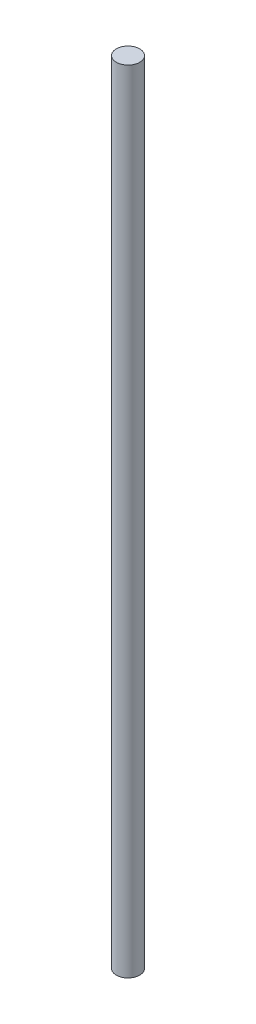
ISO-10303-21;
HEADER;
FILE_DESCRIPTION(('STEP AP214'),'2;1');
FILE_NAME('part.step','',(''),(''),'','','');
FILE_SCHEMA(('AUTOMOTIVE_DESIGN { 1 0 10303 214 1 1 1 1 }'));
ENDSEC;
DATA;
#1=APPLICATION_CONTEXT('core data for automotive mechanical design processes');
#2=APPLICATION_PROTOCOL_DEFINITION('international standard','automotive_design',2000,#1);
#3=PRODUCT_CONTEXT('',#1,'mechanical');
#4=PRODUCT('Part','Part','',(#3));
#5=PRODUCT_RELATED_PRODUCT_CATEGORY('part','',(#4));
#6=PRODUCT_DEFINITION_FORMATION('','',#4);
#7=PRODUCT_DEFINITION_CONTEXT('part definition',#1,'design');
#8=PRODUCT_DEFINITION('design','',#6,#7);
#9=PRODUCT_DEFINITION_SHAPE('','',#8);
#10=(LENGTH_UNIT() NAMED_UNIT(*) SI_UNIT(.MILLI.,.METRE.));
#11=(NAMED_UNIT(*) PLANE_ANGLE_UNIT() SI_UNIT($,.RADIAN.));
#12=(NAMED_UNIT(*) SI_UNIT($,.STERADIAN.) SOLID_ANGLE_UNIT());
#13=UNCERTAINTY_MEASURE_WITH_UNIT(LENGTH_MEASURE(1.E-05),#10,'distance_accuracy_value','');
#14=(GEOMETRIC_REPRESENTATION_CONTEXT(3) GLOBAL_UNCERTAINTY_ASSIGNED_CONTEXT((#13)) GLOBAL_UNIT_ASSIGNED_CONTEXT((#10,
#11,#12)) REPRESENTATION_CONTEXT('',''));
#15=CARTESIAN_POINT('',(0.,0.,0.));
#16=DIRECTION('',(0.,0.,1.));
#17=DIRECTION('',(1.,0.,0.));
#18=AXIS2_PLACEMENT_3D('',#15,#16,#17);
#19=CARTESIAN_POINT('',(0.,82.5903079857199,-1.2434003460271));
#20=DIRECTION('',(0.,-1.,0.));
#21=DIRECTION('',(0.,0.,-1.));
#22=AXIS2_PLACEMENT_3D('',#19,#20,#21);
#23=CYLINDRICAL_SURFACE('',#22,1.2434003460271);
#24=CARTESIAN_POINT('',(0.,79.073440720098,-1.2434003460271));
#25=DIRECTION('',(0.,-1.,0.));
#26=DIRECTION('',(0.,0.,-1.));
#27=AXIS2_PLACEMENT_3D('',#24,#25,#26);
#28=CIRCLE('',#27,1.2434003460271);
#29=CARTESIAN_POINT('',(0.,79.073440720098,-2.4868006920542));
#30=VERTEX_POINT('',#29);
#31=EDGE_CURVE('E10',#30,#30,#28,.F.);
#32=ORIENTED_EDGE('',*,*,#31,.F.);
#33=EDGE_LOOP('',(#32));
#34=FACE_BOUND('',#33,.T.);
#35=CARTESIAN_POINT('',(0.,-5.,-1.2434003460271));
#36=DIRECTION('',(0.,-1.,0.));
#37=DIRECTION('',(0.,0.,-1.));
#38=AXIS2_PLACEMENT_3D('',#35,#36,#37);
#39=CIRCLE('',#38,1.2434003460271);
#40=CARTESIAN_POINT('',(0.,-5.,-2.4868006920542));
#41=VERTEX_POINT('',#40);
#42=EDGE_CURVE('E37',#41,#41,#39,.T.);
#43=ORIENTED_EDGE('',*,*,#42,.F.);
#44=EDGE_LOOP('',(#43));
#45=FACE_BOUND('',#44,.T.);
#46=ADVANCED_FACE('F31',(#34,#45),#23,.T.);
#47=CARTESIAN_POINT('',(0.,-5.,-1.2434003460271));
#48=DIRECTION('',(0.,-1.,0.));
#49=DIRECTION('',(0.,0.,-1.));
#50=AXIS2_PLACEMENT_3D('',#47,#48,#49);
#51=PLANE('',#50);
#52=ORIENTED_EDGE('',*,*,#42,.T.);
#53=EDGE_LOOP('',(#52));
#54=FACE_BOUND('',#53,.T.);
#55=ADVANCED_FACE('F43',(#54),#51,.T.);
#56=CARTESIAN_POINT('',(35.7528892179382,79.0734407200981,-45.0803344607586));
#57=DIRECTION('',(0.,-1.,0.));
#58=DIRECTION('',(0.,0.,-1.));
#59=AXIS2_PLACEMENT_3D('',#56,#57,#58);
#60=PLANE('',#59);
#61=ORIENTED_EDGE('',*,*,#31,.T.);
#62=EDGE_LOOP('',(#61));
#63=FACE_BOUND('',#62,.T.);
#64=ADVANCED_FACE('F50',(#63),#60,.F.);
#65=CLOSED_SHELL('',(#46,#55,#64));
#66=MANIFOLD_SOLID_BREP('B2',#65);
#67=ADVANCED_BREP_SHAPE_REPRESENTATION('',(#18,#66),#14);
#68=SHAPE_DEFINITION_REPRESENTATION(#9,#67);
ENDSEC;
END-ISO-10303-21;
